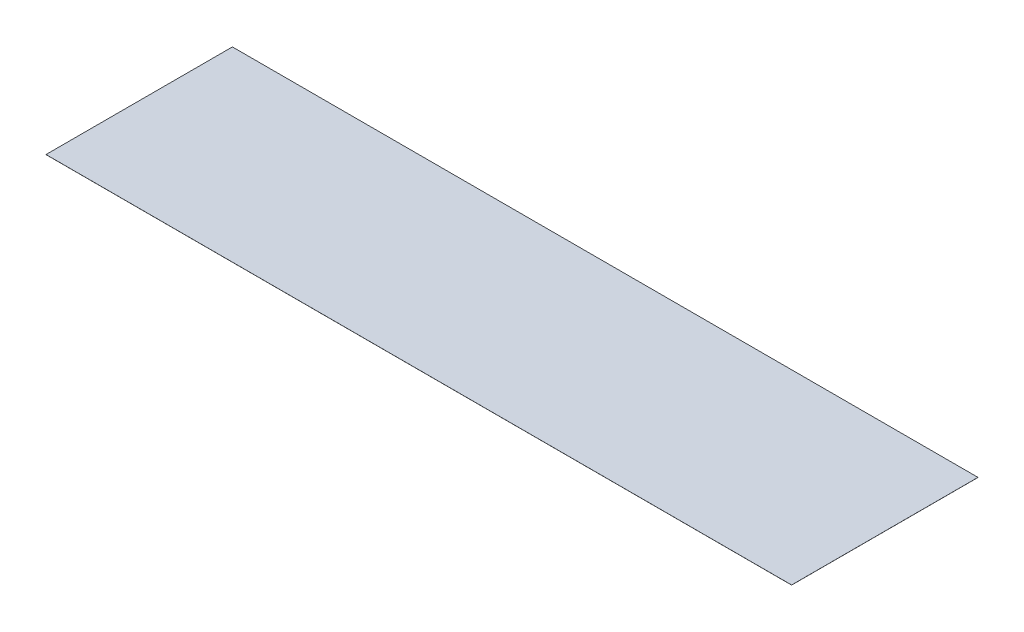
ISO-10303-21;
HEADER;
FILE_DESCRIPTION(('STEP AP214'),'2;1');
FILE_NAME('part.step','',(''),(''),'','','');
FILE_SCHEMA(('AUTOMOTIVE_DESIGN { 1 0 10303 214 1 1 1 1 }'));
ENDSEC;
DATA;
#1=APPLICATION_CONTEXT('core data for automotive mechanical design processes');
#2=APPLICATION_PROTOCOL_DEFINITION('international standard','automotive_design',2000,#1);
#3=PRODUCT_CONTEXT('',#1,'mechanical');
#4=PRODUCT('Part','Part','',(#3));
#5=PRODUCT_RELATED_PRODUCT_CATEGORY('part','',(#4));
#6=PRODUCT_DEFINITION_FORMATION('','',#4);
#7=PRODUCT_DEFINITION_CONTEXT('part definition',#1,'design');
#8=PRODUCT_DEFINITION('design','',#6,#7);
#9=PRODUCT_DEFINITION_SHAPE('','',#8);
#10=(LENGTH_UNIT() NAMED_UNIT(*) SI_UNIT(.MILLI.,.METRE.));
#11=(NAMED_UNIT(*) PLANE_ANGLE_UNIT() SI_UNIT($,.RADIAN.));
#12=(NAMED_UNIT(*) SI_UNIT($,.STERADIAN.) SOLID_ANGLE_UNIT());
#13=UNCERTAINTY_MEASURE_WITH_UNIT(LENGTH_MEASURE(1.E-05),#10,'distance_accuracy_value','');
#14=(GEOMETRIC_REPRESENTATION_CONTEXT(3) GLOBAL_UNCERTAINTY_ASSIGNED_CONTEXT((#13)) GLOBAL_UNIT_ASSIGNED_CONTEXT((#10,
#11,#12)) REPRESENTATION_CONTEXT('',''));
#15=CARTESIAN_POINT('',(0.,0.,0.));
#16=DIRECTION('',(0.,0.,1.));
#17=DIRECTION('',(1.,0.,0.));
#18=AXIS2_PLACEMENT_3D('',#15,#16,#17);
#19=CARTESIAN_POINT('',(4000.,1.,-1000.));
#20=DIRECTION('',(-1.,0.,0.));
#21=DIRECTION('',(0.,0.,1.));
#22=AXIS2_PLACEMENT_3D('',#19,#20,#21);
#23=PLANE('',#22);
#24=DIRECTION('',(0.,0.,-1.));
#25=VECTOR('',#24,1.);
#26=CARTESIAN_POINT('',(4000.,0.,-1000.));
#27=LINE('',#26,#25);
#28=CARTESIAN_POINT('',(4000.,0.,1000.));
#29=VERTEX_POINT('',#28);
#30=CARTESIAN_POINT('',(4000.,0.,-1000.));
#31=VERTEX_POINT('',#30);
#32=EDGE_CURVE('E97',#29,#31,#27,.T.);
#33=ORIENTED_EDGE('',*,*,#32,.T.);
#34=DIRECTION('',(0.,-1.,0.));
#35=VECTOR('',#34,1.);
#36=CARTESIAN_POINT('',(4000.,1.,-1000.));
#37=LINE('',#36,#35);
#38=CARTESIAN_POINT('',(4000.,1.,-1000.));
#39=VERTEX_POINT('',#38);
#40=EDGE_CURVE('E11',#39,#31,#37,.T.);
#41=ORIENTED_EDGE('',*,*,#40,.F.);
#42=DIRECTION('',(0.,0.,-1.));
#43=VECTOR('',#42,1.);
#44=CARTESIAN_POINT('',(4000.,1.,-1000.));
#45=LINE('',#44,#43);
#46=CARTESIAN_POINT('',(4000.,1.,1000.));
#47=VERTEX_POINT('',#46);
#48=EDGE_CURVE('E85',#47,#39,#45,.T.);
#49=ORIENTED_EDGE('',*,*,#48,.F.);
#50=DIRECTION('',(0.,-1.,0.));
#51=VECTOR('',#50,1.);
#52=CARTESIAN_POINT('',(4000.,1.,1000.));
#53=LINE('',#52,#51);
#54=EDGE_CURVE('E93',#47,#29,#53,.T.);
#55=ORIENTED_EDGE('',*,*,#54,.T.);
#56=EDGE_LOOP('',(#33,#41,#49,#55));
#57=FACE_BOUND('',#56,.T.);
#58=ADVANCED_FACE('F34',(#57),#23,.F.);
#59=CARTESIAN_POINT('',(-4000.,1.,-1000.));
#60=DIRECTION('',(0.,0.,1.));
#61=DIRECTION('',(1.,0.,0.));
#62=AXIS2_PLACEMENT_3D('',#59,#60,#61);
#63=PLANE('',#62);
#64=DIRECTION('',(-1.,0.,0.));
#65=VECTOR('',#64,1.);
#66=CARTESIAN_POINT('',(-4000.,0.,-1000.));
#67=LINE('',#66,#65);
#68=CARTESIAN_POINT('',(-4000.,0.,-1000.));
#69=VERTEX_POINT('',#68);
#70=EDGE_CURVE('E89',#31,#69,#67,.T.);
#71=ORIENTED_EDGE('',*,*,#70,.T.);
#72=DIRECTION('',(0.,-1.,0.));
#73=VECTOR('',#72,1.);
#74=CARTESIAN_POINT('',(-4000.,1.,-1000.));
#75=LINE('',#74,#73);
#76=CARTESIAN_POINT('',(-4000.,1.,-1000.));
#77=VERTEX_POINT('',#76);
#78=EDGE_CURVE('E42',#77,#69,#75,.T.);
#79=ORIENTED_EDGE('',*,*,#78,.F.);
#80=DIRECTION('',(-1.,0.,0.));
#81=VECTOR('',#80,1.);
#82=CARTESIAN_POINT('',(-4000.,1.,-1000.));
#83=LINE('',#82,#81);
#84=EDGE_CURVE('E80',#39,#77,#83,.T.);
#85=ORIENTED_EDGE('',*,*,#84,.F.);
#86=ORIENTED_EDGE('',*,*,#40,.T.);
#87=EDGE_LOOP('',(#71,#79,#85,#86));
#88=FACE_BOUND('',#87,.T.);
#89=ADVANCED_FACE('F88',(#88),#63,.F.);
#90=CARTESIAN_POINT('',(-4000.,1.,-1000.));
#91=DIRECTION('',(1.,0.,0.));
#92=DIRECTION('',(0.,0.,-1.));
#93=AXIS2_PLACEMENT_3D('',#90,#91,#92);
#94=PLANE('',#93);
#95=DIRECTION('',(0.,0.,1.));
#96=VECTOR('',#95,1.);
#97=CARTESIAN_POINT('',(-4000.,0.,-1000.));
#98=LINE('',#97,#96);
#99=CARTESIAN_POINT('',(-4000.,0.,1000.));
#100=VERTEX_POINT('',#99);
#101=EDGE_CURVE('E67',#69,#100,#98,.T.);
#102=ORIENTED_EDGE('',*,*,#101,.T.);
#103=DIRECTION('',(0.,-1.,0.));
#104=VECTOR('',#103,1.);
#105=CARTESIAN_POINT('',(-4000.,1.,1000.));
#106=LINE('',#105,#104);
#107=CARTESIAN_POINT('',(-4000.,1.,1000.));
#108=VERTEX_POINT('',#107);
#109=EDGE_CURVE('E90',#108,#100,#106,.T.);
#110=ORIENTED_EDGE('',*,*,#109,.F.);
#111=DIRECTION('',(0.,0.,1.));
#112=VECTOR('',#111,1.);
#113=CARTESIAN_POINT('',(-4000.,1.,-1000.));
#114=LINE('',#113,#112);
#115=EDGE_CURVE('E83',#77,#108,#114,.T.);
#116=ORIENTED_EDGE('',*,*,#115,.F.);
#117=ORIENTED_EDGE('',*,*,#78,.T.);
#118=EDGE_LOOP('',(#102,#110,#116,#117));
#119=FACE_BOUND('',#118,.T.);
#120=ADVANCED_FACE('F91',(#119),#94,.F.);
#121=CARTESIAN_POINT('',(-4000.,1.,1000.));
#122=DIRECTION('',(0.,0.,-1.));
#123=DIRECTION('',(-1.,0.,0.));
#124=AXIS2_PLACEMENT_3D('',#121,#122,#123);
#125=PLANE('',#124);
#126=DIRECTION('',(1.,0.,0.));
#127=VECTOR('',#126,1.);
#128=CARTESIAN_POINT('',(-4000.,0.,1000.));
#129=LINE('',#128,#127);
#130=EDGE_CURVE('E73',#100,#29,#129,.T.);
#131=ORIENTED_EDGE('',*,*,#130,.T.);
#132=ORIENTED_EDGE('',*,*,#54,.F.);
#133=DIRECTION('',(1.,0.,0.));
#134=VECTOR('',#133,1.);
#135=CARTESIAN_POINT('',(-4000.,1.,1000.));
#136=LINE('',#135,#134);
#137=EDGE_CURVE('E50',#108,#47,#136,.T.);
#138=ORIENTED_EDGE('',*,*,#137,.F.);
#139=ORIENTED_EDGE('',*,*,#109,.T.);
#140=EDGE_LOOP('',(#131,#132,#138,#139));
#141=FACE_BOUND('',#140,.T.);
#142=ADVANCED_FACE('F104',(#141),#125,.F.);
#143=CARTESIAN_POINT('',(0.,1.,0.));
#144=DIRECTION('',(0.,1.,0.));
#145=DIRECTION('',(0.,0.,1.));
#146=AXIS2_PLACEMENT_3D('',#143,#144,#145);
#147=PLANE('',#146);
#148=ORIENTED_EDGE('',*,*,#48,.T.);
#149=ORIENTED_EDGE('',*,*,#84,.T.);
#150=ORIENTED_EDGE('',*,*,#115,.T.);
#151=ORIENTED_EDGE('',*,*,#137,.T.);
#152=EDGE_LOOP('',(#148,#149,#150,#151));
#153=FACE_BOUND('',#152,.T.);
#154=ADVANCED_FACE('F81',(#153),#147,.T.);
#155=CARTESIAN_POINT('',(0.,0.,0.));
#156=DIRECTION('',(0.,1.,0.));
#157=DIRECTION('',(0.,0.,1.));
#158=AXIS2_PLACEMENT_3D('',#155,#156,#157);
#159=PLANE('',#158);
#160=ORIENTED_EDGE('',*,*,#32,.F.);
#161=ORIENTED_EDGE('',*,*,#130,.F.);
#162=ORIENTED_EDGE('',*,*,#101,.F.);
#163=ORIENTED_EDGE('',*,*,#70,.F.);
#164=EDGE_LOOP('',(#160,#161,#162,#163));
#165=FACE_BOUND('',#164,.T.);
#166=ADVANCED_FACE('F107',(#165),#159,.F.);
#167=CLOSED_SHELL('',(#58,#89,#120,#142,#154,#166));
#168=MANIFOLD_SOLID_BREP('B2',#167);
#169=ADVANCED_BREP_SHAPE_REPRESENTATION('',(#18,#168),#14);
#170=SHAPE_DEFINITION_REPRESENTATION(#9,#169);
ENDSEC;
END-ISO-10303-21;
